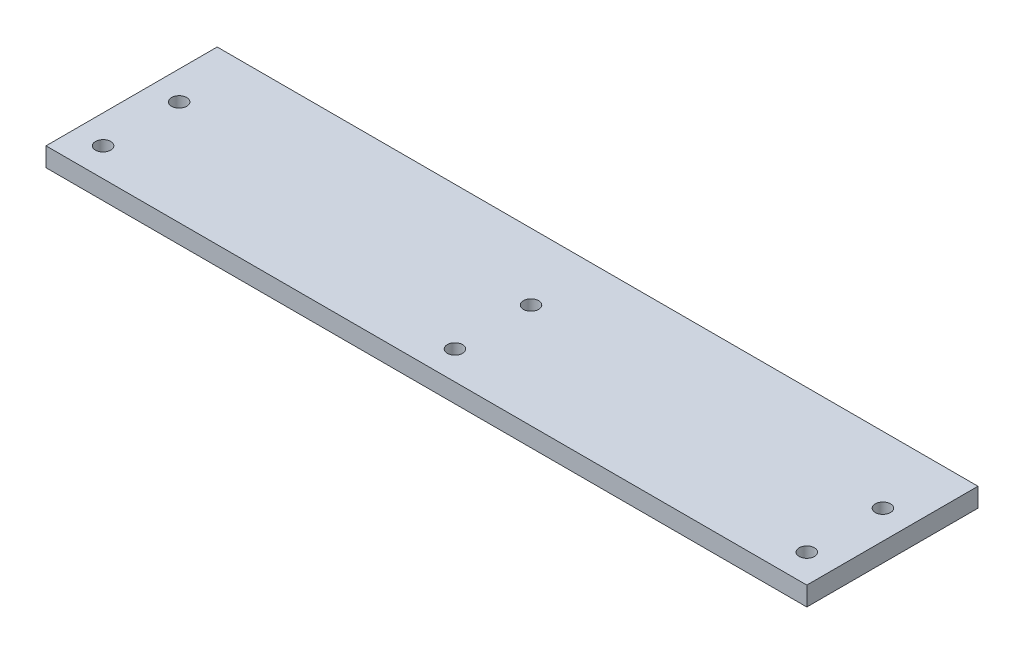
ISO-10303-21;
HEADER;
FILE_DESCRIPTION(('STEP AP214'),'2;1');
FILE_NAME('part.step','',(''),(''),'','','');
FILE_SCHEMA(('AUTOMOTIVE_DESIGN { 1 0 10303 214 1 1 1 1 }'));
ENDSEC;
DATA;
#1=APPLICATION_CONTEXT('core data for automotive mechanical design processes');
#2=APPLICATION_PROTOCOL_DEFINITION('international standard','automotive_design',2000,#1);
#3=PRODUCT_CONTEXT('',#1,'mechanical');
#4=PRODUCT('Part','Part','',(#3));
#5=PRODUCT_RELATED_PRODUCT_CATEGORY('part','',(#4));
#6=PRODUCT_DEFINITION_FORMATION('','',#4);
#7=PRODUCT_DEFINITION_CONTEXT('part definition',#1,'design');
#8=PRODUCT_DEFINITION('design','',#6,#7);
#9=PRODUCT_DEFINITION_SHAPE('','',#8);
#10=(LENGTH_UNIT() NAMED_UNIT(*) SI_UNIT(.MILLI.,.METRE.));
#11=(NAMED_UNIT(*) PLANE_ANGLE_UNIT() SI_UNIT($,.RADIAN.));
#12=(NAMED_UNIT(*) SI_UNIT($,.STERADIAN.) SOLID_ANGLE_UNIT());
#13=UNCERTAINTY_MEASURE_WITH_UNIT(LENGTH_MEASURE(1.E-05),#10,'distance_accuracy_value','');
#14=(GEOMETRIC_REPRESENTATION_CONTEXT(3) GLOBAL_UNCERTAINTY_ASSIGNED_CONTEXT((#13)) GLOBAL_UNIT_ASSIGNED_CONTEXT((#10,
#11,#12)) REPRESENTATION_CONTEXT('',''));
#15=CARTESIAN_POINT('',(0.,0.,0.));
#16=DIRECTION('',(0.,0.,1.));
#17=DIRECTION('',(1.,0.,0.));
#18=AXIS2_PLACEMENT_3D('',#15,#16,#17);
#19=CARTESIAN_POINT('',(-63.5,3.175,0.));
#20=DIRECTION('',(-1.,0.,0.));
#21=DIRECTION('',(0.,0.,1.));
#22=AXIS2_PLACEMENT_3D('',#19,#20,#21);
#23=PLANE('',#22);
#24=DIRECTION('',(0.,0.,-1.));
#25=VECTOR('',#24,1.);
#26=CARTESIAN_POINT('',(-63.5,0.,0.));
#27=LINE('',#26,#25);
#28=CARTESIAN_POINT('',(-63.5,0.,12.7));
#29=VERTEX_POINT('',#28);
#30=CARTESIAN_POINT('',(-63.5,0.,-15.875));
#31=VERTEX_POINT('',#30);
#32=EDGE_CURVE('E119',#29,#31,#27,.T.);
#33=ORIENTED_EDGE('',*,*,#32,.F.);
#34=DIRECTION('',(0.,-1.,0.));
#35=VECTOR('',#34,1.);
#36=CARTESIAN_POINT('',(-63.5,3.175,12.7));
#37=LINE('',#36,#35);
#38=CARTESIAN_POINT('',(-63.5,3.175,12.7));
#39=VERTEX_POINT('',#38);
#40=EDGE_CURVE('E11',#39,#29,#37,.T.);
#41=ORIENTED_EDGE('',*,*,#40,.F.);
#42=DIRECTION('',(0.,0.,-1.));
#43=VECTOR('',#42,1.);
#44=CARTESIAN_POINT('',(-63.5,3.175,0.));
#45=LINE('',#44,#43);
#46=CARTESIAN_POINT('',(-63.5,3.175,-15.875));
#47=VERTEX_POINT('',#46);
#48=EDGE_CURVE('E94',#39,#47,#45,.T.);
#49=ORIENTED_EDGE('',*,*,#48,.T.);
#50=DIRECTION('',(0.,-1.,0.));
#51=VECTOR('',#50,1.);
#52=CARTESIAN_POINT('',(-63.5,3.175,-15.875));
#53=LINE('',#52,#51);
#54=EDGE_CURVE('E52',#47,#31,#53,.T.);
#55=ORIENTED_EDGE('',*,*,#54,.T.);
#56=EDGE_LOOP('',(#33,#41,#49,#55));
#57=FACE_BOUND('',#56,.T.);
#58=ADVANCED_FACE('F35',(#57),#23,.T.);
#59=CARTESIAN_POINT('',(0.,3.175,12.7));
#60=DIRECTION('',(0.,0.,1.));
#61=DIRECTION('',(1.,0.,0.));
#62=AXIS2_PLACEMENT_3D('',#59,#60,#61);
#63=PLANE('',#62);
#64=DIRECTION('',(-1.,0.,0.));
#65=VECTOR('',#64,1.);
#66=CARTESIAN_POINT('',(0.,0.,12.7));
#67=LINE('',#66,#65);
#68=CARTESIAN_POINT('',(63.5,0.,12.7));
#69=VERTEX_POINT('',#68);
#70=EDGE_CURVE('E84',#69,#29,#67,.T.);
#71=ORIENTED_EDGE('',*,*,#70,.F.);
#72=DIRECTION('',(0.,-1.,0.));
#73=VECTOR('',#72,1.);
#74=CARTESIAN_POINT('',(63.5,3.175,12.7));
#75=LINE('',#74,#73);
#76=CARTESIAN_POINT('',(63.5,3.175,12.7));
#77=VERTEX_POINT('',#76);
#78=EDGE_CURVE('E44',#77,#69,#75,.T.);
#79=ORIENTED_EDGE('',*,*,#78,.F.);
#80=DIRECTION('',(-1.,0.,0.));
#81=VECTOR('',#80,1.);
#82=CARTESIAN_POINT('',(0.,3.175,12.7));
#83=LINE('',#82,#81);
#84=EDGE_CURVE('E82',#77,#39,#83,.T.);
#85=ORIENTED_EDGE('',*,*,#84,.T.);
#86=ORIENTED_EDGE('',*,*,#40,.T.);
#87=EDGE_LOOP('',(#71,#79,#85,#86));
#88=FACE_BOUND('',#87,.T.);
#89=ADVANCED_FACE('F80',(#88),#63,.T.);
#90=CARTESIAN_POINT('',(63.5,3.175,0.));
#91=DIRECTION('',(-1.,0.,0.));
#92=DIRECTION('',(0.,0.,1.));
#93=AXIS2_PLACEMENT_3D('',#90,#91,#92);
#94=PLANE('',#93);
#95=DIRECTION('',(0.,0.,-1.));
#96=VECTOR('',#95,1.);
#97=CARTESIAN_POINT('',(63.5,0.,0.));
#98=LINE('',#97,#96);
#99=CARTESIAN_POINT('',(63.5,0.,-15.875));
#100=VERTEX_POINT('',#99);
#101=EDGE_CURVE('E122',#69,#100,#98,.T.);
#102=ORIENTED_EDGE('',*,*,#101,.T.);
#103=DIRECTION('',(0.,-1.,0.));
#104=VECTOR('',#103,1.);
#105=CARTESIAN_POINT('',(63.5,3.175,-15.875));
#106=LINE('',#105,#104);
#107=CARTESIAN_POINT('',(63.5,3.175,-15.875));
#108=VERTEX_POINT('',#107);
#109=EDGE_CURVE('E66',#108,#100,#106,.T.);
#110=ORIENTED_EDGE('',*,*,#109,.F.);
#111=DIRECTION('',(0.,0.,-1.));
#112=VECTOR('',#111,1.);
#113=CARTESIAN_POINT('',(63.5,3.175,0.));
#114=LINE('',#113,#112);
#115=EDGE_CURVE('E87',#77,#108,#114,.T.);
#116=ORIENTED_EDGE('',*,*,#115,.F.);
#117=ORIENTED_EDGE('',*,*,#78,.T.);
#118=EDGE_LOOP('',(#102,#110,#116,#117));
#119=FACE_BOUND('',#118,.T.);
#120=ADVANCED_FACE('F88',(#119),#94,.F.);
#121=CARTESIAN_POINT('',(-58.7375,3.175,-4.76249999999999));
#122=DIRECTION('',(0.,-1.,0.));
#123=DIRECTION('',(0.,0.,-1.));
#124=AXIS2_PLACEMENT_3D('',#121,#122,#123);
#125=CYLINDRICAL_SURFACE('',#124,1.26999999999999);
#126=CARTESIAN_POINT('',(-58.7375,3.175,-4.76249999999999));
#127=DIRECTION('',(0.,1.,0.));
#128=DIRECTION('',(0.,0.,1.));
#129=AXIS2_PLACEMENT_3D('',#126,#127,#128);
#130=CIRCLE('',#129,1.26999999999999);
#131=CARTESIAN_POINT('',(-58.7375,3.175,-3.49249999999999));
#132=VERTEX_POINT('',#131);
#133=EDGE_CURVE('E96',#132,#132,#130,.T.);
#134=ORIENTED_EDGE('',*,*,#133,.T.);
#135=EDGE_LOOP('',(#134));
#136=FACE_BOUND('',#135,.T.);
#137=CARTESIAN_POINT('',(-58.7375,0.,-4.76249999999999));
#138=DIRECTION('',(0.,1.,0.));
#139=DIRECTION('',(0.,0.,1.));
#140=AXIS2_PLACEMENT_3D('',#137,#138,#139);
#141=CIRCLE('',#140,1.26999999999999);
#142=CARTESIAN_POINT('',(-58.7375,0.,-3.49249999999999));
#143=VERTEX_POINT('',#142);
#144=EDGE_CURVE('E116',#143,#143,#141,.T.);
#145=ORIENTED_EDGE('',*,*,#144,.F.);
#146=EDGE_LOOP('',(#145));
#147=FACE_BOUND('',#146,.T.);
#148=ADVANCED_FACE('F149',(#136,#147),#125,.F.);
#149=CARTESIAN_POINT('',(0.,3.175,-4.76249999999999));
#150=DIRECTION('',(0.,-1.,0.));
#151=DIRECTION('',(0.,0.,-1.));
#152=AXIS2_PLACEMENT_3D('',#149,#150,#151);
#153=CYLINDRICAL_SURFACE('',#152,1.27);
#154=CARTESIAN_POINT('',(0.,3.175,-4.76249999999999));
#155=DIRECTION('',(0.,1.,0.));
#156=DIRECTION('',(0.,0.,1.));
#157=AXIS2_PLACEMENT_3D('',#154,#155,#156);
#158=CIRCLE('',#157,1.27);
#159=CARTESIAN_POINT('',(0.,3.175,-3.49249999999999));
#160=VERTEX_POINT('',#159);
#161=EDGE_CURVE('E144',#160,#160,#158,.T.);
#162=ORIENTED_EDGE('',*,*,#161,.T.);
#163=EDGE_LOOP('',(#162));
#164=FACE_BOUND('',#163,.T.);
#165=CARTESIAN_POINT('',(0.,0.,-4.76249999999999));
#166=DIRECTION('',(0.,1.,0.));
#167=DIRECTION('',(0.,0.,1.));
#168=AXIS2_PLACEMENT_3D('',#165,#166,#167);
#169=CIRCLE('',#168,1.27);
#170=CARTESIAN_POINT('',(0.,0.,-3.49249999999999));
#171=VERTEX_POINT('',#170);
#172=EDGE_CURVE('E113',#171,#171,#169,.T.);
#173=ORIENTED_EDGE('',*,*,#172,.F.);
#174=EDGE_LOOP('',(#173));
#175=FACE_BOUND('',#174,.T.);
#176=ADVANCED_FACE('F175',(#164,#175),#153,.F.);
#177=CARTESIAN_POINT('',(58.7375,3.175,-4.76249999999999));
#178=DIRECTION('',(0.,-1.,0.));
#179=DIRECTION('',(0.,0.,-1.));
#180=AXIS2_PLACEMENT_3D('',#177,#178,#179);
#181=CYLINDRICAL_SURFACE('',#180,1.26999999999999);
#182=CARTESIAN_POINT('',(58.7375,3.175,-4.76249999999999));
#183=DIRECTION('',(0.,1.,0.));
#184=DIRECTION('',(0.,0.,1.));
#185=AXIS2_PLACEMENT_3D('',#182,#183,#184);
#186=CIRCLE('',#185,1.26999999999999);
#187=CARTESIAN_POINT('',(58.7375,3.175,-3.49249999999999));
#188=VERTEX_POINT('',#187);
#189=EDGE_CURVE('E141',#188,#188,#186,.T.);
#190=ORIENTED_EDGE('',*,*,#189,.T.);
#191=EDGE_LOOP('',(#190));
#192=FACE_BOUND('',#191,.T.);
#193=CARTESIAN_POINT('',(58.7375,0.,-4.76249999999999));
#194=DIRECTION('',(0.,1.,0.));
#195=DIRECTION('',(0.,0.,1.));
#196=AXIS2_PLACEMENT_3D('',#193,#194,#195);
#197=CIRCLE('',#196,1.26999999999999);
#198=CARTESIAN_POINT('',(58.7375,0.,-3.49249999999999));
#199=VERTEX_POINT('',#198);
#200=EDGE_CURVE('E110',#199,#199,#197,.T.);
#201=ORIENTED_EDGE('',*,*,#200,.F.);
#202=EDGE_LOOP('',(#201));
#203=FACE_BOUND('',#202,.T.);
#204=ADVANCED_FACE('F178',(#192,#203),#181,.F.);
#205=CARTESIAN_POINT('',(-58.7375,3.175,7.93750000000001));
#206=DIRECTION('',(0.,-1.,0.));
#207=DIRECTION('',(0.,0.,-1.));
#208=AXIS2_PLACEMENT_3D('',#205,#206,#207);
#209=CYLINDRICAL_SURFACE('',#208,1.26999999999999);
#210=CARTESIAN_POINT('',(-58.7375,3.175,7.93750000000001));
#211=DIRECTION('',(0.,1.,0.));
#212=DIRECTION('',(0.,0.,1.));
#213=AXIS2_PLACEMENT_3D('',#210,#211,#212);
#214=CIRCLE('',#213,1.26999999999999);
#215=CARTESIAN_POINT('',(-58.7375,3.175,9.2075));
#216=VERTEX_POINT('',#215);
#217=EDGE_CURVE('E136',#216,#216,#214,.T.);
#218=ORIENTED_EDGE('',*,*,#217,.T.);
#219=EDGE_LOOP('',(#218));
#220=FACE_BOUND('',#219,.T.);
#221=CARTESIAN_POINT('',(-58.7375,0.,7.93750000000001));
#222=DIRECTION('',(0.,1.,0.));
#223=DIRECTION('',(0.,0.,1.));
#224=AXIS2_PLACEMENT_3D('',#221,#222,#223);
#225=CIRCLE('',#224,1.26999999999999);
#226=CARTESIAN_POINT('',(-58.7375,0.,9.2075));
#227=VERTEX_POINT('',#226);
#228=EDGE_CURVE('E107',#227,#227,#225,.T.);
#229=ORIENTED_EDGE('',*,*,#228,.F.);
#230=EDGE_LOOP('',(#229));
#231=FACE_BOUND('',#230,.T.);
#232=ADVANCED_FACE('F182',(#220,#231),#209,.F.);
#233=CARTESIAN_POINT('',(0.,3.175,7.93750000000001));
#234=DIRECTION('',(0.,-1.,0.));
#235=DIRECTION('',(0.,0.,-1.));
#236=AXIS2_PLACEMENT_3D('',#233,#234,#235);
#237=CYLINDRICAL_SURFACE('',#236,1.27);
#238=CARTESIAN_POINT('',(0.,3.175,7.93750000000001));
#239=DIRECTION('',(0.,1.,0.));
#240=DIRECTION('',(0.,0.,1.));
#241=AXIS2_PLACEMENT_3D('',#238,#239,#240);
#242=CIRCLE('',#241,1.27);
#243=CARTESIAN_POINT('',(0.,3.175,9.20750000000001));
#244=VERTEX_POINT('',#243);
#245=EDGE_CURVE('E131',#244,#244,#242,.T.);
#246=ORIENTED_EDGE('',*,*,#245,.T.);
#247=EDGE_LOOP('',(#246));
#248=FACE_BOUND('',#247,.T.);
#249=CARTESIAN_POINT('',(0.,0.,7.93750000000001));
#250=DIRECTION('',(0.,1.,0.));
#251=DIRECTION('',(0.,0.,1.));
#252=AXIS2_PLACEMENT_3D('',#249,#250,#251);
#253=CIRCLE('',#252,1.27);
#254=CARTESIAN_POINT('',(0.,0.,9.20750000000001));
#255=VERTEX_POINT('',#254);
#256=EDGE_CURVE('E104',#255,#255,#253,.T.);
#257=ORIENTED_EDGE('',*,*,#256,.F.);
#258=EDGE_LOOP('',(#257));
#259=FACE_BOUND('',#258,.T.);
#260=ADVANCED_FACE('F185',(#248,#259),#237,.F.);
#261=CARTESIAN_POINT('',(58.7375,3.175,7.93750000000001));
#262=DIRECTION('',(0.,-1.,0.));
#263=DIRECTION('',(0.,0.,-1.));
#264=AXIS2_PLACEMENT_3D('',#261,#262,#263);
#265=CYLINDRICAL_SURFACE('',#264,1.26999999999999);
#266=CARTESIAN_POINT('',(58.7375,3.175,7.93750000000001));
#267=DIRECTION('',(0.,1.,0.));
#268=DIRECTION('',(0.,0.,1.));
#269=AXIS2_PLACEMENT_3D('',#266,#267,#268);
#270=CIRCLE('',#269,1.26999999999999);
#271=CARTESIAN_POINT('',(58.7375,3.175,9.2075));
#272=VERTEX_POINT('',#271);
#273=EDGE_CURVE('E127',#272,#272,#270,.T.);
#274=ORIENTED_EDGE('',*,*,#273,.T.);
#275=EDGE_LOOP('',(#274));
#276=FACE_BOUND('',#275,.T.);
#277=CARTESIAN_POINT('',(58.7375,0.,7.93750000000001));
#278=DIRECTION('',(0.,1.,0.));
#279=DIRECTION('',(0.,0.,1.));
#280=AXIS2_PLACEMENT_3D('',#277,#278,#279);
#281=CIRCLE('',#280,1.26999999999999);
#282=CARTESIAN_POINT('',(58.7375,0.,9.2075));
#283=VERTEX_POINT('',#282);
#284=EDGE_CURVE('E101',#283,#283,#281,.T.);
#285=ORIENTED_EDGE('',*,*,#284,.F.);
#286=EDGE_LOOP('',(#285));
#287=FACE_BOUND('',#286,.T.);
#288=ADVANCED_FACE('F37',(#276,#287),#265,.F.);
#289=CARTESIAN_POINT('',(0.,3.175,-15.875));
#290=DIRECTION('',(0.,0.,-1.));
#291=DIRECTION('',(-1.,0.,0.));
#292=AXIS2_PLACEMENT_3D('',#289,#290,#291);
#293=PLANE('',#292);
#294=DIRECTION('',(1.,0.,0.));
#295=VECTOR('',#294,1.);
#296=CARTESIAN_POINT('',(0.,0.,-15.875));
#297=LINE('',#296,#295);
#298=EDGE_CURVE('E124',#31,#100,#297,.T.);
#299=ORIENTED_EDGE('',*,*,#298,.F.);
#300=ORIENTED_EDGE('',*,*,#54,.F.);
#301=DIRECTION('',(1.,0.,0.));
#302=VECTOR('',#301,1.);
#303=CARTESIAN_POINT('',(0.,3.175,-15.875));
#304=LINE('',#303,#302);
#305=EDGE_CURVE('E91',#47,#108,#304,.T.);
#306=ORIENTED_EDGE('',*,*,#305,.T.);
#307=ORIENTED_EDGE('',*,*,#109,.T.);
#308=EDGE_LOOP('',(#299,#300,#306,#307));
#309=FACE_BOUND('',#308,.T.);
#310=ADVANCED_FACE('F154',(#309),#293,.T.);
#311=CARTESIAN_POINT('',(0.,3.175,0.));
#312=DIRECTION('',(0.,1.,0.));
#313=DIRECTION('',(0.,0.,1.));
#314=AXIS2_PLACEMENT_3D('',#311,#312,#313);
#315=PLANE('',#314);
#316=ORIENTED_EDGE('',*,*,#273,.F.);
#317=EDGE_LOOP('',(#316));
#318=FACE_BOUND('',#317,.T.);
#319=ORIENTED_EDGE('',*,*,#245,.F.);
#320=EDGE_LOOP('',(#319));
#321=FACE_BOUND('',#320,.T.);
#322=ORIENTED_EDGE('',*,*,#217,.F.);
#323=EDGE_LOOP('',(#322));
#324=FACE_BOUND('',#323,.T.);
#325=ORIENTED_EDGE('',*,*,#189,.F.);
#326=EDGE_LOOP('',(#325));
#327=FACE_BOUND('',#326,.T.);
#328=ORIENTED_EDGE('',*,*,#161,.F.);
#329=EDGE_LOOP('',(#328));
#330=FACE_BOUND('',#329,.T.);
#331=ORIENTED_EDGE('',*,*,#133,.F.);
#332=EDGE_LOOP('',(#331));
#333=FACE_BOUND('',#332,.T.);
#334=ORIENTED_EDGE('',*,*,#48,.F.);
#335=ORIENTED_EDGE('',*,*,#84,.F.);
#336=ORIENTED_EDGE('',*,*,#115,.T.);
#337=ORIENTED_EDGE('',*,*,#305,.F.);
#338=EDGE_LOOP('',(#334,#335,#336,#337));
#339=FACE_BOUND('',#338,.T.);
#340=ADVANCED_FACE('F93',(#318,#321,#324,#327,#330,#333,#339),#315,.T.);
#341=CARTESIAN_POINT('',(0.,0.,0.));
#342=DIRECTION('',(0.,1.,0.));
#343=DIRECTION('',(0.,0.,1.));
#344=AXIS2_PLACEMENT_3D('',#341,#342,#343);
#345=PLANE('',#344);
#346=ORIENTED_EDGE('',*,*,#284,.T.);
#347=EDGE_LOOP('',(#346));
#348=FACE_BOUND('',#347,.T.);
#349=ORIENTED_EDGE('',*,*,#256,.T.);
#350=EDGE_LOOP('',(#349));
#351=FACE_BOUND('',#350,.T.);
#352=ORIENTED_EDGE('',*,*,#228,.T.);
#353=EDGE_LOOP('',(#352));
#354=FACE_BOUND('',#353,.T.);
#355=ORIENTED_EDGE('',*,*,#200,.T.);
#356=EDGE_LOOP('',(#355));
#357=FACE_BOUND('',#356,.T.);
#358=ORIENTED_EDGE('',*,*,#172,.T.);
#359=EDGE_LOOP('',(#358));
#360=FACE_BOUND('',#359,.T.);
#361=ORIENTED_EDGE('',*,*,#144,.T.);
#362=EDGE_LOOP('',(#361));
#363=FACE_BOUND('',#362,.T.);
#364=ORIENTED_EDGE('',*,*,#32,.T.);
#365=ORIENTED_EDGE('',*,*,#298,.T.);
#366=ORIENTED_EDGE('',*,*,#101,.F.);
#367=ORIENTED_EDGE('',*,*,#70,.T.);
#368=EDGE_LOOP('',(#364,#365,#366,#367));
#369=FACE_BOUND('',#368,.T.);
#370=ADVANCED_FACE('F153',(#348,#351,#354,#357,#360,#363,#369),#345,.F.);
#371=CLOSED_SHELL('',(#58,#89,#120,#148,#176,#204,#232,#260,#288,#310,#340,#370));
#372=MANIFOLD_SOLID_BREP('B2',#371);
#373=ADVANCED_BREP_SHAPE_REPRESENTATION('',(#18,#372),#14);
#374=SHAPE_DEFINITION_REPRESENTATION(#9,#373);
ENDSEC;
END-ISO-10303-21;
